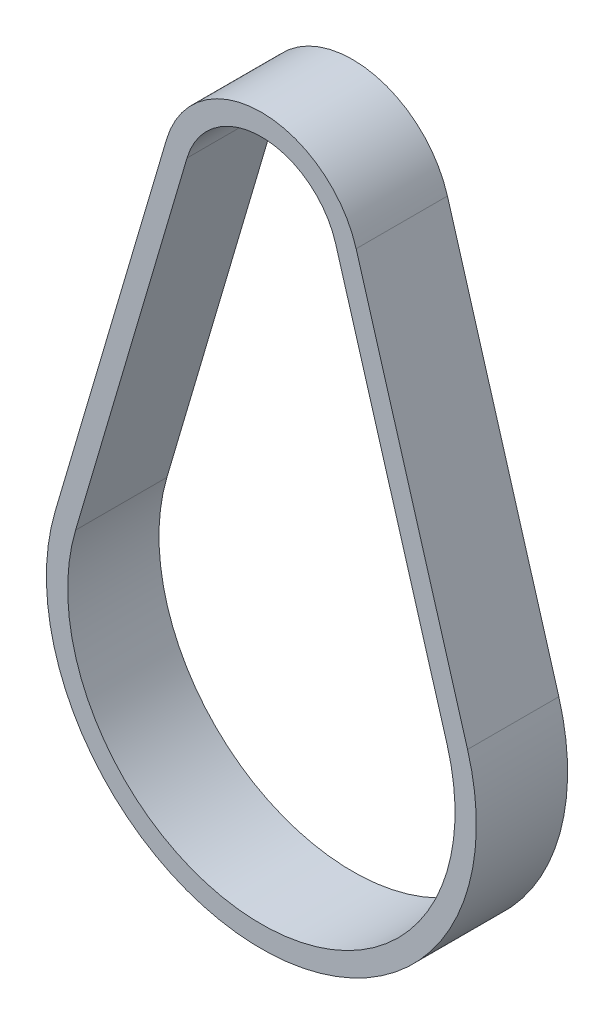
ISO-10303-21;
HEADER;
FILE_DESCRIPTION(('STEP AP214'),'2;1');
FILE_NAME('part.step','',(''),(''),'','','');
FILE_SCHEMA(('AUTOMOTIVE_DESIGN { 1 0 10303 214 1 1 1 1 }'));
ENDSEC;
DATA;
#1=APPLICATION_CONTEXT('core data for automotive mechanical design processes');
#2=APPLICATION_PROTOCOL_DEFINITION('international standard','automotive_design',2000,#1);
#3=PRODUCT_CONTEXT('',#1,'mechanical');
#4=PRODUCT('Part','Part','',(#3));
#5=PRODUCT_RELATED_PRODUCT_CATEGORY('part','',(#4));
#6=PRODUCT_DEFINITION_FORMATION('','',#4);
#7=PRODUCT_DEFINITION_CONTEXT('part definition',#1,'design');
#8=PRODUCT_DEFINITION('design','',#6,#7);
#9=PRODUCT_DEFINITION_SHAPE('','',#8);
#10=(LENGTH_UNIT() NAMED_UNIT(*) SI_UNIT(.MILLI.,.METRE.));
#11=(NAMED_UNIT(*) PLANE_ANGLE_UNIT() SI_UNIT($,.RADIAN.));
#12=(NAMED_UNIT(*) SI_UNIT($,.STERADIAN.) SOLID_ANGLE_UNIT());
#13=UNCERTAINTY_MEASURE_WITH_UNIT(LENGTH_MEASURE(1.E-05),#10,'distance_accuracy_value','');
#14=(GEOMETRIC_REPRESENTATION_CONTEXT(3) GLOBAL_UNCERTAINTY_ASSIGNED_CONTEXT((#13)) GLOBAL_UNIT_ASSIGNED_CONTEXT((#10,
#11,#12)) REPRESENTATION_CONTEXT('',''));
#15=CARTESIAN_POINT('',(0.,0.,0.));
#16=DIRECTION('',(0.,0.,1.));
#17=DIRECTION('',(1.,0.,0.));
#18=AXIS2_PLACEMENT_3D('',#15,#16,#17);
#19=CARTESIAN_POINT('',(-12.4082119989736,-5.92442191175885,-6.00000000000001));
#20=DIRECTION('',(0.,0.,1.));
#21=DIRECTION('',(1.,0.,0.));
#22=AXIS2_PLACEMENT_3D('',#19,#20,#21);
#23=CYLINDRICAL_SURFACE('',#22,14.13);
#24=CARTESIAN_POINT('',(-12.4082119989736,-5.92442191175885,0.));
#25=DIRECTION('',(0.,0.,-1.));
#26=DIRECTION('',(-1.,0.,0.));
#27=AXIS2_PLACEMENT_3D('',#24,#25,#26);
#28=CIRCLE('',#27,14.13);
#29=CARTESIAN_POINT('',(-25.9615024141273,-1.9287719117585,0.));
#30=VERTEX_POINT('',#29);
#31=CARTESIAN_POINT('',(1.14507841618042,-1.92877191175947,0.));
#32=VERTEX_POINT('',#31);
#33=EDGE_CURVE('E156',#30,#32,#28,.F.);
#34=ORIENTED_EDGE('',*,*,#33,.F.);
#35=DIRECTION('',(0.,0.,1.));
#36=VECTOR('',#35,1.);
#37=CARTESIAN_POINT('',(-25.9615024141273,-1.9287719117585,-6.00000000000001));
#38=LINE('',#37,#36);
#39=CARTESIAN_POINT('',(-25.9615024141273,-1.9287719117585,-6.00000000000001));
#40=VERTEX_POINT('',#39);
#41=EDGE_CURVE('E12',#40,#30,#38,.T.);
#42=ORIENTED_EDGE('',*,*,#41,.F.);
#43=CARTESIAN_POINT('',(-12.4082119989736,-5.92442191175885,-6.00000000000001));
#44=DIRECTION('',(0.,0.,-1.));
#45=DIRECTION('',(-1.,0.,0.));
#46=AXIS2_PLACEMENT_3D('',#43,#44,#45);
#47=CIRCLE('',#46,14.13);
#48=CARTESIAN_POINT('',(1.14507841618042,-1.92877191175947,-6.00000000000001));
#49=VERTEX_POINT('',#48);
#50=EDGE_CURVE('E160',#40,#49,#47,.F.);
#51=ORIENTED_EDGE('',*,*,#50,.T.);
#52=DIRECTION('',(0.,0.,1.));
#53=VECTOR('',#52,1.);
#54=CARTESIAN_POINT('',(1.14507841618042,-1.92877191175947,-6.00000000000001));
#55=LINE('',#54,#53);
#56=EDGE_CURVE('E61',#49,#32,#55,.T.);
#57=ORIENTED_EDGE('',*,*,#56,.T.);
#58=EDGE_LOOP('',(#34,#42,#51,#57));
#59=FACE_BOUND('',#58,.T.);
#60=ADVANCED_FACE('F58',(#59),#23,.T.);
#61=CARTESIAN_POINT('',(-25.9615024141273,-1.9287719117585,-6.00000000000001));
#62=DIRECTION('',(-0.959185450470892,0.282777777777802,0.));
#63=DIRECTION('',(-0.282777777777802,-0.959185450470892,0.));
#64=AXIS2_PLACEMENT_3D('',#61,#62,#63);
#65=PLANE('',#64);
#66=DIRECTION('',(-0.282777777777802,-0.959185450470892,0.));
#67=VECTOR('',#66,1.);
#68=CARTESIAN_POINT('',(-25.9615024141273,-1.9287719117585,0.));
#69=LINE('',#68,#67);
#70=CARTESIAN_POINT('',(-18.6381214997811,22.9122197549087,0.));
#71=VERTEX_POINT('',#70);
#72=EDGE_CURVE('E164',#71,#30,#69,.T.);
#73=ORIENTED_EDGE('',*,*,#72,.F.);
#74=DIRECTION('',(0.,0.,1.));
#75=VECTOR('',#74,1.);
#76=CARTESIAN_POINT('',(-18.6381214997811,22.9122197549087,-6.00000000000001));
#77=LINE('',#76,#75);
#78=CARTESIAN_POINT('',(-18.6381214997811,22.9122197549087,-6.00000000000001));
#79=VERTEX_POINT('',#78);
#80=EDGE_CURVE('E66',#79,#71,#77,.T.);
#81=ORIENTED_EDGE('',*,*,#80,.F.);
#82=DIRECTION('',(-0.282777777777802,-0.959185450470892,0.));
#83=VECTOR('',#82,1.);
#84=CARTESIAN_POINT('',(-25.9615024141273,-1.9287719117585,-6.00000000000001));
#85=LINE('',#84,#83);
#86=EDGE_CURVE('E170',#79,#40,#85,.T.);
#87=ORIENTED_EDGE('',*,*,#86,.T.);
#88=ORIENTED_EDGE('',*,*,#41,.T.);
#89=EDGE_LOOP('',(#73,#81,#87,#88));
#90=FACE_BOUND('',#89,.T.);
#91=ADVANCED_FACE('F196',(#90),#65,.T.);
#92=CARTESIAN_POINT('',(-12.4082119989726,21.075578088242,-6.00000000000001));
#93=DIRECTION('',(0.,0.,1.));
#94=DIRECTION('',(1.,0.,0.));
#95=AXIS2_PLACEMENT_3D('',#92,#93,#94);
#96=CYLINDRICAL_SURFACE('',#95,6.495);
#97=CARTESIAN_POINT('',(-12.4082119989726,21.075578088242,0.));
#98=DIRECTION('',(0.,0.,-1.));
#99=DIRECTION('',(-1.,0.,0.));
#100=AXIS2_PLACEMENT_3D('',#97,#98,#99);
#101=CIRCLE('',#100,6.495);
#102=CARTESIAN_POINT('',(-6.17830249816407,22.9122197549084,0.));
#103=VERTEX_POINT('',#102);
#104=EDGE_CURVE('E178',#103,#71,#101,.F.);
#105=ORIENTED_EDGE('',*,*,#104,.F.);
#106=DIRECTION('',(0.,0.,1.));
#107=VECTOR('',#106,1.);
#108=CARTESIAN_POINT('',(-6.17830249816407,22.9122197549084,-6.00000000000001));
#109=LINE('',#108,#107);
#110=CARTESIAN_POINT('',(-6.17830249816407,22.9122197549084,-6.00000000000001));
#111=VERTEX_POINT('',#110);
#112=EDGE_CURVE('E183',#111,#103,#109,.T.);
#113=ORIENTED_EDGE('',*,*,#112,.F.);
#114=CARTESIAN_POINT('',(-12.4082119989726,21.075578088242,-6.00000000000001));
#115=DIRECTION('',(0.,0.,-1.));
#116=DIRECTION('',(-1.,0.,0.));
#117=AXIS2_PLACEMENT_3D('',#114,#115,#116);
#118=CIRCLE('',#117,6.495);
#119=EDGE_CURVE('E167',#111,#79,#118,.F.);
#120=ORIENTED_EDGE('',*,*,#119,.T.);
#121=ORIENTED_EDGE('',*,*,#80,.T.);
#122=EDGE_LOOP('',(#105,#113,#120,#121));
#123=FACE_BOUND('',#122,.T.);
#124=ADVANCED_FACE('F200',(#123),#96,.T.);
#125=CARTESIAN_POINT('',(1.14507841618042,-1.92877191175947,-6.00000000000001));
#126=DIRECTION('',(0.959185450470911,0.282777777777737,0.));
#127=DIRECTION('',(-0.282777777777737,0.959185450470911,0.));
#128=AXIS2_PLACEMENT_3D('',#125,#126,#127);
#129=PLANE('',#128);
#130=DIRECTION('',(-0.282777777777737,0.959185450470911,0.));
#131=VECTOR('',#130,1.);
#132=CARTESIAN_POINT('',(1.14507841618042,-1.92877191175947,0.));
#133=LINE('',#132,#131);
#134=EDGE_CURVE('E175',#32,#103,#133,.T.);
#135=ORIENTED_EDGE('',*,*,#134,.F.);
#136=ORIENTED_EDGE('',*,*,#56,.F.);
#137=DIRECTION('',(-0.282777777777737,0.959185450470911,0.));
#138=VECTOR('',#137,1.);
#139=CARTESIAN_POINT('',(1.14507841618042,-1.92877191175947,-6.00000000000001));
#140=LINE('',#139,#138);
#141=EDGE_CURVE('E163',#49,#111,#140,.T.);
#142=ORIENTED_EDGE('',*,*,#141,.T.);
#143=ORIENTED_EDGE('',*,*,#112,.T.);
#144=EDGE_LOOP('',(#135,#136,#142,#143));
#145=FACE_BOUND('',#144,.T.);
#146=ADVANCED_FACE('F191',(#145),#129,.T.);
#147=CARTESIAN_POINT('',(-12.4082119989736,-5.92442191175885,-6.00000000000001));
#148=DIRECTION('',(0.,0.,-1.));
#149=DIRECTION('',(-1.,0.,0.));
#150=AXIS2_PLACEMENT_3D('',#147,#148,#149);
#151=PLANE('',#150);
#152=CARTESIAN_POINT('',(-12.4082119989736,-5.92442191175885,-6.00000000000001));
#153=DIRECTION('',(0.,0.,1.));
#154=DIRECTION('',(-1.,0.,0.));
#155=AXIS2_PLACEMENT_3D('',#152,#153,#154);
#156=CIRCLE('',#155,12.73);
#157=CARTESIAN_POINT('',(-24.618642783468,-2.32466080064747,-6.00000000000001));
#158=VERTEX_POINT('',#157);
#159=CARTESIAN_POINT('',(-0.197781214478852,-2.32466080064825,-6.00000000000001));
#160=VERTEX_POINT('',#159);
#161=EDGE_CURVE('E125',#158,#160,#156,.T.);
#162=ORIENTED_EDGE('',*,*,#161,.T.);
#163=DIRECTION('',(-0.282777777777737,0.959185450470911,0.));
#164=VECTOR('',#163,1.);
#165=CARTESIAN_POINT('',(-7.52116212882335,22.5163308660195,-6.00000000000001));
#166=LINE('',#165,#164);
#167=CARTESIAN_POINT('',(-7.52116212882335,22.5163308660195,-6.00000000000001));
#168=VERTEX_POINT('',#167);
#169=EDGE_CURVE('E134',#160,#168,#166,.T.);
#170=ORIENTED_EDGE('',*,*,#169,.T.);
#171=CARTESIAN_POINT('',(-12.4082119989726,21.075578088242,-6.00000000000001));
#172=DIRECTION('',(0.,0.,1.));
#173=DIRECTION('',(-1.,0.,0.));
#174=AXIS2_PLACEMENT_3D('',#171,#172,#173);
#175=CIRCLE('',#174,5.095);
#176=CARTESIAN_POINT('',(-17.2952618691219,22.5163308660199,-6.00000000000001));
#177=VERTEX_POINT('',#176);
#178=EDGE_CURVE('E74',#168,#177,#175,.T.);
#179=ORIENTED_EDGE('',*,*,#178,.T.);
#180=DIRECTION('',(-0.282777777777802,-0.959185450470892,0.));
#181=VECTOR('',#180,1.);
#182=CARTESIAN_POINT('',(-24.618642783468,-2.32466080064747,-6.00000000000001));
#183=LINE('',#182,#181);
#184=EDGE_CURVE('E131',#177,#158,#183,.T.);
#185=ORIENTED_EDGE('',*,*,#184,.T.);
#186=EDGE_LOOP('',(#162,#170,#179,#185));
#187=FACE_BOUND('',#186,.T.);
#188=ORIENTED_EDGE('',*,*,#50,.F.);
#189=ORIENTED_EDGE('',*,*,#86,.F.);
#190=ORIENTED_EDGE('',*,*,#119,.F.);
#191=ORIENTED_EDGE('',*,*,#141,.F.);
#192=EDGE_LOOP('',(#188,#189,#190,#191));
#193=FACE_BOUND('',#192,.T.);
#194=ADVANCED_FACE('F138',(#187,#193),#151,.T.);
#195=CARTESIAN_POINT('',(-12.4082119989736,-5.92442191175885,0.));
#196=DIRECTION('',(0.,0.,-1.));
#197=DIRECTION('',(-1.,0.,0.));
#198=AXIS2_PLACEMENT_3D('',#195,#196,#197);
#199=PLANE('',#198);
#200=DIRECTION('',(-0.282777777777737,0.959185450470911,0.));
#201=VECTOR('',#200,1.);
#202=CARTESIAN_POINT('',(-7.52116212882335,22.5163308660195,0.));
#203=LINE('',#202,#201);
#204=CARTESIAN_POINT('',(-0.197781214478852,-2.32466080064825,0.));
#205=VERTEX_POINT('',#204);
#206=CARTESIAN_POINT('',(-7.52116212882335,22.5163308660195,0.));
#207=VERTEX_POINT('',#206);
#208=EDGE_CURVE('E150',#205,#207,#203,.T.);
#209=ORIENTED_EDGE('',*,*,#208,.F.);
#210=CARTESIAN_POINT('',(-12.4082119989736,-5.92442191175885,0.));
#211=DIRECTION('',(0.,0.,1.));
#212=DIRECTION('',(-1.,0.,0.));
#213=AXIS2_PLACEMENT_3D('',#210,#211,#212);
#214=CIRCLE('',#213,12.73);
#215=CARTESIAN_POINT('',(-24.618642783468,-2.32466080064747,0.));
#216=VERTEX_POINT('',#215);
#217=EDGE_CURVE('E82',#216,#205,#214,.T.);
#218=ORIENTED_EDGE('',*,*,#217,.F.);
#219=DIRECTION('',(-0.282777777777802,-0.959185450470892,0.));
#220=VECTOR('',#219,1.);
#221=CARTESIAN_POINT('',(-24.618642783468,-2.32466080064747,0.));
#222=LINE('',#221,#220);
#223=CARTESIAN_POINT('',(-17.2952618691219,22.5163308660199,0.));
#224=VERTEX_POINT('',#223);
#225=EDGE_CURVE('E141',#224,#216,#222,.T.);
#226=ORIENTED_EDGE('',*,*,#225,.F.);
#227=CARTESIAN_POINT('',(-12.4082119989726,21.075578088242,0.));
#228=DIRECTION('',(0.,0.,1.));
#229=DIRECTION('',(-1.,0.,0.));
#230=AXIS2_PLACEMENT_3D('',#227,#228,#229);
#231=CIRCLE('',#230,5.095);
#232=EDGE_CURVE('E144',#207,#224,#231,.T.);
#233=ORIENTED_EDGE('',*,*,#232,.F.);
#234=EDGE_LOOP('',(#209,#218,#226,#233));
#235=FACE_BOUND('',#234,.T.);
#236=ORIENTED_EDGE('',*,*,#33,.T.);
#237=ORIENTED_EDGE('',*,*,#134,.T.);
#238=ORIENTED_EDGE('',*,*,#104,.T.);
#239=ORIENTED_EDGE('',*,*,#72,.T.);
#240=EDGE_LOOP('',(#236,#237,#238,#239));
#241=FACE_BOUND('',#240,.T.);
#242=ADVANCED_FACE('F193',(#235,#241),#199,.F.);
#243=CARTESIAN_POINT('',(-12.4082119989736,-5.92442191175885,-6.00000000000001));
#244=DIRECTION('',(0.,0.,1.));
#245=DIRECTION('',(1.,0.,0.));
#246=AXIS2_PLACEMENT_3D('',#243,#244,#245);
#247=CYLINDRICAL_SURFACE('',#246,12.73);
#248=ORIENTED_EDGE('',*,*,#217,.T.);
#249=DIRECTION('',(0.,0.,1.));
#250=VECTOR('',#249,1.);
#251=CARTESIAN_POINT('',(-0.197781214478852,-2.32466080064825,-6.00000000000001));
#252=LINE('',#251,#250);
#253=EDGE_CURVE('E121',#160,#205,#252,.T.);
#254=ORIENTED_EDGE('',*,*,#253,.F.);
#255=ORIENTED_EDGE('',*,*,#161,.F.);
#256=DIRECTION('',(0.,0.,1.));
#257=VECTOR('',#256,1.);
#258=CARTESIAN_POINT('',(-24.618642783468,-2.32466080064747,-6.00000000000001));
#259=LINE('',#258,#257);
#260=EDGE_CURVE('E154',#158,#216,#259,.T.);
#261=ORIENTED_EDGE('',*,*,#260,.T.);
#262=EDGE_LOOP('',(#248,#254,#255,#261));
#263=FACE_BOUND('',#262,.T.);
#264=ADVANCED_FACE('F123',(#263),#247,.F.);
#265=CARTESIAN_POINT('',(-24.618642783468,-2.32466080064747,-6.00000000000001));
#266=DIRECTION('',(-0.959185450470892,0.282777777777802,0.));
#267=DIRECTION('',(-0.282777777777802,-0.959185450470892,0.));
#268=AXIS2_PLACEMENT_3D('',#265,#266,#267);
#269=PLANE('',#268);
#270=ORIENTED_EDGE('',*,*,#225,.T.);
#271=ORIENTED_EDGE('',*,*,#260,.F.);
#272=ORIENTED_EDGE('',*,*,#184,.F.);
#273=DIRECTION('',(0.,0.,1.));
#274=VECTOR('',#273,1.);
#275=CARTESIAN_POINT('',(-17.2952618691219,22.5163308660199,-6.00000000000001));
#276=LINE('',#275,#274);
#277=EDGE_CURVE('E157',#177,#224,#276,.T.);
#278=ORIENTED_EDGE('',*,*,#277,.T.);
#279=EDGE_LOOP('',(#270,#271,#272,#278));
#280=FACE_BOUND('',#279,.T.);
#281=ADVANCED_FACE('F251',(#280),#269,.F.);
#282=CARTESIAN_POINT('',(-12.4082119989726,21.075578088242,-6.00000000000001));
#283=DIRECTION('',(0.,0.,1.));
#284=DIRECTION('',(1.,0.,0.));
#285=AXIS2_PLACEMENT_3D('',#282,#283,#284);
#286=CYLINDRICAL_SURFACE('',#285,5.095);
#287=ORIENTED_EDGE('',*,*,#232,.T.);
#288=ORIENTED_EDGE('',*,*,#277,.F.);
#289=ORIENTED_EDGE('',*,*,#178,.F.);
#290=DIRECTION('',(0.,0.,1.));
#291=VECTOR('',#290,1.);
#292=CARTESIAN_POINT('',(-7.52116212882335,22.5163308660195,-6.00000000000001));
#293=LINE('',#292,#291);
#294=EDGE_CURVE('E130',#168,#207,#293,.T.);
#295=ORIENTED_EDGE('',*,*,#294,.T.);
#296=EDGE_LOOP('',(#287,#288,#289,#295));
#297=FACE_BOUND('',#296,.T.);
#298=ADVANCED_FACE('F260',(#297),#286,.F.);
#299=CARTESIAN_POINT('',(-7.52116212882335,22.5163308660195,-6.00000000000001));
#300=DIRECTION('',(0.959185450470911,0.282777777777737,0.));
#301=DIRECTION('',(-0.282777777777737,0.959185450470911,0.));
#302=AXIS2_PLACEMENT_3D('',#299,#300,#301);
#303=PLANE('',#302);
#304=ORIENTED_EDGE('',*,*,#208,.T.);
#305=ORIENTED_EDGE('',*,*,#294,.F.);
#306=ORIENTED_EDGE('',*,*,#169,.F.);
#307=ORIENTED_EDGE('',*,*,#253,.T.);
#308=EDGE_LOOP('',(#304,#305,#306,#307));
#309=FACE_BOUND('',#308,.T.);
#310=ADVANCED_FACE('F135',(#309),#303,.F.);
#311=CLOSED_SHELL('',(#60,#91,#124,#146,#194,#242,#264,#281,#298,#310));
#312=MANIFOLD_SOLID_BREP('B2',#311);
#313=ADVANCED_BREP_SHAPE_REPRESENTATION('',(#18,#312),#14);
#314=SHAPE_DEFINITION_REPRESENTATION(#9,#313);
ENDSEC;
END-ISO-10303-21;
